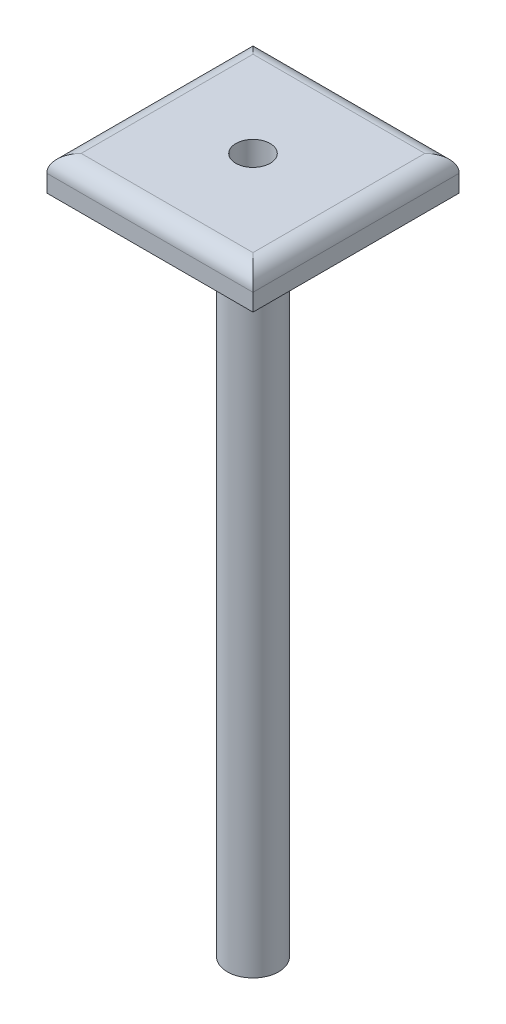
ISO-10303-21;
HEADER;
FILE_DESCRIPTION(('STEP AP214'),'2;1');
FILE_NAME('part.step','',(''),(''),'','','');
FILE_SCHEMA(('AUTOMOTIVE_DESIGN { 1 0 10303 214 1 1 1 1 }'));
ENDSEC;
DATA;
#1=APPLICATION_CONTEXT('core data for automotive mechanical design processes');
#2=APPLICATION_PROTOCOL_DEFINITION('international standard','automotive_design',2000,#1);
#3=PRODUCT_CONTEXT('',#1,'mechanical');
#4=PRODUCT('Part','Part','',(#3));
#5=PRODUCT_RELATED_PRODUCT_CATEGORY('part','',(#4));
#6=PRODUCT_DEFINITION_FORMATION('','',#4);
#7=PRODUCT_DEFINITION_CONTEXT('part definition',#1,'design');
#8=PRODUCT_DEFINITION('design','',#6,#7);
#9=PRODUCT_DEFINITION_SHAPE('','',#8);
#10=(LENGTH_UNIT() NAMED_UNIT(*) SI_UNIT(.MILLI.,.METRE.));
#11=(NAMED_UNIT(*) PLANE_ANGLE_UNIT() SI_UNIT($,.RADIAN.));
#12=(NAMED_UNIT(*) SI_UNIT($,.STERADIAN.) SOLID_ANGLE_UNIT());
#13=UNCERTAINTY_MEASURE_WITH_UNIT(LENGTH_MEASURE(1.E-05),#10,'distance_accuracy_value','');
#14=(GEOMETRIC_REPRESENTATION_CONTEXT(3) GLOBAL_UNCERTAINTY_ASSIGNED_CONTEXT((#13)) GLOBAL_UNIT_ASSIGNED_CONTEXT((#10,
#11,#12)) REPRESENTATION_CONTEXT('',''));
#15=CARTESIAN_POINT('',(0.,0.,0.));
#16=DIRECTION('',(0.,0.,1.));
#17=DIRECTION('',(1.,0.,0.));
#18=AXIS2_PLACEMENT_3D('',#15,#16,#17);
#19=CARTESIAN_POINT('',(15.24,5.08,-15.24));
#20=DIRECTION('',(-1.,0.,0.));
#21=DIRECTION('',(0.,0.,1.));
#22=AXIS2_PLACEMENT_3D('',#19,#20,#21);
#23=PLANE('',#22);
#24=DIRECTION('',(0.,-1.,0.));
#25=VECTOR('',#24,1.);
#26=CARTESIAN_POINT('',(15.24,5.08,-15.24));
#27=LINE('',#26,#25);
#28=CARTESIAN_POINT('',(15.24,2.54,-15.24));
#29=VERTEX_POINT('',#28);
#30=CARTESIAN_POINT('',(15.24,0.,-15.24));
#31=VERTEX_POINT('',#30);
#32=EDGE_CURVE('E94',#29,#31,#27,.T.);
#33=ORIENTED_EDGE('',*,*,#32,.F.);
#34=DIRECTION('',(0.,0.,-1.));
#35=VECTOR('',#34,1.);
#36=CARTESIAN_POINT('',(15.24,2.54,15.24));
#37=LINE('',#36,#35);
#38=CARTESIAN_POINT('',(15.24,2.54,15.24));
#39=VERTEX_POINT('',#38);
#40=EDGE_CURVE('E49',#29,#39,#37,.F.);
#41=ORIENTED_EDGE('',*,*,#40,.T.);
#42=DIRECTION('',(0.,-1.,0.));
#43=VECTOR('',#42,1.);
#44=CARTESIAN_POINT('',(15.24,5.08,15.24));
#45=LINE('',#44,#43);
#46=CARTESIAN_POINT('',(15.24,0.,15.24));
#47=VERTEX_POINT('',#46);
#48=EDGE_CURVE('E116',#39,#47,#45,.T.);
#49=ORIENTED_EDGE('',*,*,#48,.T.);
#50=DIRECTION('',(0.,0.,-1.));
#51=VECTOR('',#50,1.);
#52=CARTESIAN_POINT('',(15.24,0.,-15.24));
#53=LINE('',#52,#51);
#54=EDGE_CURVE('E110',#47,#31,#53,.T.);
#55=ORIENTED_EDGE('',*,*,#54,.T.);
#56=EDGE_LOOP('',(#33,#41,#49,#55));
#57=FACE_BOUND('',#56,.T.);
#58=ADVANCED_FACE('F39',(#57),#23,.F.);
#59=CARTESIAN_POINT('',(-15.24,5.08,-15.24));
#60=DIRECTION('',(0.,0.,1.));
#61=DIRECTION('',(1.,0.,0.));
#62=AXIS2_PLACEMENT_3D('',#59,#60,#61);
#63=PLANE('',#62);
#64=DIRECTION('',(0.,-1.,0.));
#65=VECTOR('',#64,1.);
#66=CARTESIAN_POINT('',(-15.24,5.08,-15.24));
#67=LINE('',#66,#65);
#68=CARTESIAN_POINT('',(-15.24,2.54,-15.24));
#69=VERTEX_POINT('',#68);
#70=CARTESIAN_POINT('',(-15.24,0.,-15.24));
#71=VERTEX_POINT('',#70);
#72=EDGE_CURVE('E104',#69,#71,#67,.T.);
#73=ORIENTED_EDGE('',*,*,#72,.F.);
#74=DIRECTION('',(-1.,0.,0.));
#75=VECTOR('',#74,1.);
#76=CARTESIAN_POINT('',(15.24,2.54,-15.24));
#77=LINE('',#76,#75);
#78=EDGE_CURVE('E57',#69,#29,#77,.F.);
#79=ORIENTED_EDGE('',*,*,#78,.T.);
#80=ORIENTED_EDGE('',*,*,#32,.T.);
#81=DIRECTION('',(-1.,0.,0.));
#82=VECTOR('',#81,1.);
#83=CARTESIAN_POINT('',(-15.24,0.,-15.24));
#84=LINE('',#83,#82);
#85=EDGE_CURVE('E97',#31,#71,#84,.T.);
#86=ORIENTED_EDGE('',*,*,#85,.T.);
#87=EDGE_LOOP('',(#73,#79,#80,#86));
#88=FACE_BOUND('',#87,.T.);
#89=ADVANCED_FACE('F96',(#88),#63,.F.);
#90=CARTESIAN_POINT('',(-15.24,5.08,-15.24));
#91=DIRECTION('',(1.,0.,0.));
#92=DIRECTION('',(0.,0.,-1.));
#93=AXIS2_PLACEMENT_3D('',#90,#91,#92);
#94=PLANE('',#93);
#95=DIRECTION('',(0.,-1.,0.));
#96=VECTOR('',#95,1.);
#97=CARTESIAN_POINT('',(-15.24,5.08,15.24));
#98=LINE('',#97,#96);
#99=CARTESIAN_POINT('',(-15.24,2.54,15.24));
#100=VERTEX_POINT('',#99);
#101=CARTESIAN_POINT('',(-15.24,0.,15.24));
#102=VERTEX_POINT('',#101);
#103=EDGE_CURVE('E132',#100,#102,#98,.T.);
#104=ORIENTED_EDGE('',*,*,#103,.F.);
#105=DIRECTION('',(0.,0.,1.));
#106=VECTOR('',#105,1.);
#107=CARTESIAN_POINT('',(-15.24,2.54,-15.24));
#108=LINE('',#107,#106);
#109=EDGE_CURVE('E65',#100,#69,#108,.F.);
#110=ORIENTED_EDGE('',*,*,#109,.T.);
#111=ORIENTED_EDGE('',*,*,#72,.T.);
#112=DIRECTION('',(0.,0.,1.));
#113=VECTOR('',#112,1.);
#114=CARTESIAN_POINT('',(-15.24,0.,-15.24));
#115=LINE('',#114,#113);
#116=EDGE_CURVE('E112',#71,#102,#115,.T.);
#117=ORIENTED_EDGE('',*,*,#116,.T.);
#118=EDGE_LOOP('',(#104,#110,#111,#117));
#119=FACE_BOUND('',#118,.T.);
#120=ADVANCED_FACE('F185',(#119),#94,.F.);
#121=CARTESIAN_POINT('',(-15.24,5.08,15.24));
#122=DIRECTION('',(0.,0.,-1.));
#123=DIRECTION('',(-1.,0.,0.));
#124=AXIS2_PLACEMENT_3D('',#121,#122,#123);
#125=PLANE('',#124);
#126=ORIENTED_EDGE('',*,*,#48,.F.);
#127=DIRECTION('',(1.,0.,0.));
#128=VECTOR('',#127,1.);
#129=CARTESIAN_POINT('',(-15.24,2.54,15.24));
#130=LINE('',#129,#128);
#131=EDGE_CURVE('E149',#39,#100,#130,.F.);
#132=ORIENTED_EDGE('',*,*,#131,.T.);
#133=ORIENTED_EDGE('',*,*,#103,.T.);
#134=DIRECTION('',(1.,0.,0.));
#135=VECTOR('',#134,1.);
#136=CARTESIAN_POINT('',(-15.24,0.,15.24));
#137=LINE('',#136,#135);
#138=EDGE_CURVE('E127',#102,#47,#137,.T.);
#139=ORIENTED_EDGE('',*,*,#138,.T.);
#140=EDGE_LOOP('',(#126,#132,#133,#139));
#141=FACE_BOUND('',#140,.T.);
#142=ADVANCED_FACE('F184',(#141),#125,.F.);
#143=CARTESIAN_POINT('',(0.,5.08,0.));
#144=DIRECTION('',(0.,1.,0.));
#145=DIRECTION('',(0.,0.,1.));
#146=AXIS2_PLACEMENT_3D('',#143,#144,#145);
#147=PLANE('',#146);
#148=CARTESIAN_POINT('',(0.,5.08,0.));
#149=DIRECTION('',(0.,1.,0.));
#150=DIRECTION('',(0.,0.,1.));
#151=AXIS2_PLACEMENT_3D('',#148,#149,#150);
#152=CIRCLE('',#151,2.54);
#153=CARTESIAN_POINT('',(0.,5.08,2.54));
#154=VERTEX_POINT('',#153);
#155=EDGE_CURVE('E241',#154,#154,#152,.T.);
#156=ORIENTED_EDGE('',*,*,#155,.F.);
#157=EDGE_LOOP('',(#156));
#158=FACE_BOUND('',#157,.T.);
#159=DIRECTION('',(0.,0.,1.));
#160=VECTOR('',#159,1.);
#161=CARTESIAN_POINT('',(-12.7,5.08,15.24));
#162=LINE('',#161,#160);
#163=CARTESIAN_POINT('',(-12.7,5.08,-12.7));
#164=VERTEX_POINT('',#163);
#165=CARTESIAN_POINT('',(-12.7,5.08,12.7));
#166=VERTEX_POINT('',#165);
#167=EDGE_CURVE('E142',#164,#166,#162,.T.);
#168=ORIENTED_EDGE('',*,*,#167,.T.);
#169=DIRECTION('',(1.,0.,0.));
#170=VECTOR('',#169,1.);
#171=CARTESIAN_POINT('',(15.24,5.08,12.7));
#172=LINE('',#171,#170);
#173=CARTESIAN_POINT('',(12.7,5.08,12.7));
#174=VERTEX_POINT('',#173);
#175=EDGE_CURVE('E145',#166,#174,#172,.T.);
#176=ORIENTED_EDGE('',*,*,#175,.T.);
#177=DIRECTION('',(0.,0.,-1.));
#178=VECTOR('',#177,1.);
#179=CARTESIAN_POINT('',(12.7,5.08,-15.24));
#180=LINE('',#179,#178);
#181=CARTESIAN_POINT('',(12.7,5.08,-12.7));
#182=VERTEX_POINT('',#181);
#183=EDGE_CURVE('E103',#174,#182,#180,.T.);
#184=ORIENTED_EDGE('',*,*,#183,.T.);
#185=DIRECTION('',(-1.,0.,0.));
#186=VECTOR('',#185,1.);
#187=CARTESIAN_POINT('',(-15.24,5.08,-12.7));
#188=LINE('',#187,#186);
#189=EDGE_CURVE('E139',#182,#164,#188,.T.);
#190=ORIENTED_EDGE('',*,*,#189,.T.);
#191=EDGE_LOOP('',(#168,#176,#184,#190));
#192=FACE_BOUND('',#191,.T.);
#193=ADVANCED_FACE('F177',(#158,#192),#147,.T.);
#194=CARTESIAN_POINT('',(0.,0.,0.));
#195=DIRECTION('',(0.,1.,0.));
#196=DIRECTION('',(0.,0.,1.));
#197=AXIS2_PLACEMENT_3D('',#194,#195,#196);
#198=PLANE('',#197);
#199=CARTESIAN_POINT('',(0.,0.,0.));
#200=DIRECTION('',(0.,-1.,0.));
#201=DIRECTION('',(0.,0.,-1.));
#202=AXIS2_PLACEMENT_3D('',#199,#200,#201);
#203=CIRCLE('',#202,3.81);
#204=CARTESIAN_POINT('',(0.,0.,-3.81));
#205=VERTEX_POINT('',#204);
#206=EDGE_CURVE('E11',#205,#205,#203,.T.);
#207=ORIENTED_EDGE('',*,*,#206,.F.);
#208=EDGE_LOOP('',(#207));
#209=FACE_BOUND('',#208,.T.);
#210=ORIENTED_EDGE('',*,*,#54,.F.);
#211=ORIENTED_EDGE('',*,*,#138,.F.);
#212=ORIENTED_EDGE('',*,*,#116,.F.);
#213=ORIENTED_EDGE('',*,*,#85,.F.);
#214=EDGE_LOOP('',(#210,#211,#212,#213));
#215=FACE_BOUND('',#214,.T.);
#216=ADVANCED_FACE('F108',(#209,#215),#198,.F.);
#217=CARTESIAN_POINT('',(0.,2.54,-12.7));
#218=DIRECTION('',(1.,0.,0.));
#219=DIRECTION('',(0.,0.,-1.));
#220=AXIS2_PLACEMENT_3D('',#217,#218,#219);
#221=CYLINDRICAL_SURFACE('',#220,2.54);
#222=CARTESIAN_POINT('',(12.7,2.54,-12.7));
#223=DIRECTION('',(0.707106781186547,0.,0.707106781186547));
#224=DIRECTION('',(-0.707106781186547,0.,0.707106781186547));
#225=AXIS2_PLACEMENT_3D('',#222,#223,#224);
#226=ELLIPSE('',#225,3.59210244842766,2.54);
#227=EDGE_CURVE('E122',#29,#182,#226,.T.);
#228=ORIENTED_EDGE('',*,*,#227,.F.);
#229=ORIENTED_EDGE('',*,*,#78,.F.);
#230=CARTESIAN_POINT('',(-12.7,2.54,-12.7));
#231=DIRECTION('',(0.707106781186547,0.,-0.707106781186548));
#232=DIRECTION('',(0.707106781186548,0.,0.707106781186547));
#233=AXIS2_PLACEMENT_3D('',#230,#231,#232);
#234=ELLIPSE('',#233,3.59210244842766,2.54);
#235=EDGE_CURVE('E43',#164,#69,#234,.F.);
#236=ORIENTED_EDGE('',*,*,#235,.F.);
#237=ORIENTED_EDGE('',*,*,#189,.F.);
#238=EDGE_LOOP('',(#228,#229,#236,#237));
#239=FACE_BOUND('',#238,.T.);
#240=ADVANCED_FACE('F41',(#239),#221,.T.);
#241=CARTESIAN_POINT('',(-12.7,2.54,0.));
#242=DIRECTION('',(0.,0.,-1.));
#243=DIRECTION('',(-1.,0.,0.));
#244=AXIS2_PLACEMENT_3D('',#241,#242,#243);
#245=CYLINDRICAL_SURFACE('',#244,2.54);
#246=ORIENTED_EDGE('',*,*,#235,.T.);
#247=ORIENTED_EDGE('',*,*,#109,.F.);
#248=CARTESIAN_POINT('',(-12.7,2.54,12.7));
#249=DIRECTION('',(-0.707106781186548,0.,-0.707106781186547));
#250=DIRECTION('',(0.707106781186547,0.,-0.707106781186548));
#251=AXIS2_PLACEMENT_3D('',#248,#249,#250);
#252=ELLIPSE('',#251,3.59210244842766,2.54);
#253=EDGE_CURVE('E162',#166,#100,#252,.F.);
#254=ORIENTED_EDGE('',*,*,#253,.F.);
#255=ORIENTED_EDGE('',*,*,#167,.F.);
#256=EDGE_LOOP('',(#246,#247,#254,#255));
#257=FACE_BOUND('',#256,.T.);
#258=ADVANCED_FACE('F203',(#257),#245,.T.);
#259=CARTESIAN_POINT('',(12.7,2.54,0.));
#260=DIRECTION('',(0.,0.,1.));
#261=DIRECTION('',(1.,0.,0.));
#262=AXIS2_PLACEMENT_3D('',#259,#260,#261);
#263=CYLINDRICAL_SURFACE('',#262,2.54);
#264=ORIENTED_EDGE('',*,*,#227,.T.);
#265=ORIENTED_EDGE('',*,*,#183,.F.);
#266=CARTESIAN_POINT('',(12.7,2.54,12.7));
#267=DIRECTION('',(-0.707106781186547,0.,0.707106781186547));
#268=DIRECTION('',(0.707106781186547,0.,0.707106781186547));
#269=AXIS2_PLACEMENT_3D('',#266,#267,#268);
#270=ELLIPSE('',#269,3.59210244842766,2.54);
#271=EDGE_CURVE('E159',#39,#174,#270,.T.);
#272=ORIENTED_EDGE('',*,*,#271,.F.);
#273=ORIENTED_EDGE('',*,*,#40,.F.);
#274=EDGE_LOOP('',(#264,#265,#272,#273));
#275=FACE_BOUND('',#274,.T.);
#276=ADVANCED_FACE('F170',(#275),#263,.T.);
#277=CARTESIAN_POINT('',(0.,2.54,12.7));
#278=DIRECTION('',(-1.,0.,0.));
#279=DIRECTION('',(0.,0.,1.));
#280=AXIS2_PLACEMENT_3D('',#277,#278,#279);
#281=CYLINDRICAL_SURFACE('',#280,2.54);
#282=ORIENTED_EDGE('',*,*,#253,.T.);
#283=ORIENTED_EDGE('',*,*,#131,.F.);
#284=ORIENTED_EDGE('',*,*,#271,.T.);
#285=ORIENTED_EDGE('',*,*,#175,.F.);
#286=EDGE_LOOP('',(#282,#283,#284,#285));
#287=FACE_BOUND('',#286,.T.);
#288=ADVANCED_FACE('F181',(#287),#281,.T.);
#289=CARTESIAN_POINT('',(0.,-97.79,0.));
#290=DIRECTION('',(0.,1.,0.));
#291=DIRECTION('',(0.,0.,1.));
#292=AXIS2_PLACEMENT_3D('',#289,#290,#291);
#293=CYLINDRICAL_SURFACE('',#292,3.81);
#294=CARTESIAN_POINT('',(0.,-97.79,0.));
#295=DIRECTION('',(0.,-1.,0.));
#296=DIRECTION('',(0.,0.,-1.));
#297=AXIS2_PLACEMENT_3D('',#294,#295,#296);
#298=CIRCLE('',#297,3.81);
#299=CARTESIAN_POINT('',(0.,-97.79,-3.81));
#300=VERTEX_POINT('',#299);
#301=EDGE_CURVE('E163',#300,#300,#298,.T.);
#302=ORIENTED_EDGE('',*,*,#301,.F.);
#303=EDGE_LOOP('',(#302));
#304=FACE_BOUND('',#303,.T.);
#305=ORIENTED_EDGE('',*,*,#206,.T.);
#306=EDGE_LOOP('',(#305));
#307=FACE_BOUND('',#306,.T.);
#308=ADVANCED_FACE('F201',(#304,#307),#293,.T.);
#309=CARTESIAN_POINT('',(0.,-97.79,0.));
#310=DIRECTION('',(0.,-1.,0.));
#311=DIRECTION('',(0.,0.,-1.));
#312=AXIS2_PLACEMENT_3D('',#309,#310,#311);
#313=PLANE('',#312);
#314=ORIENTED_EDGE('',*,*,#301,.T.);
#315=EDGE_LOOP('',(#314));
#316=FACE_BOUND('',#315,.T.);
#317=ADVANCED_FACE('F223',(#316),#313,.T.);
#318=CARTESIAN_POINT('',(0.,-96.52,0.));
#319=DIRECTION('',(0.,1.,0.));
#320=DIRECTION('',(0.,0.,1.));
#321=AXIS2_PLACEMENT_3D('',#318,#319,#320);
#322=CYLINDRICAL_SURFACE('',#321,2.54);
#323=CARTESIAN_POINT('',(0.,-96.52,0.));
#324=DIRECTION('',(0.,1.,0.));
#325=DIRECTION('',(0.,0.,1.));
#326=AXIS2_PLACEMENT_3D('',#323,#324,#325);
#327=CIRCLE('',#326,2.54);
#328=CARTESIAN_POINT('',(0.,-96.52,2.54));
#329=VERTEX_POINT('',#328);
#330=EDGE_CURVE('E239',#329,#329,#327,.T.);
#331=ORIENTED_EDGE('',*,*,#330,.F.);
#332=EDGE_LOOP('',(#331));
#333=FACE_BOUND('',#332,.T.);
#334=ORIENTED_EDGE('',*,*,#155,.T.);
#335=EDGE_LOOP('',(#334));
#336=FACE_BOUND('',#335,.T.);
#337=ADVANCED_FACE('F227',(#333,#336),#322,.F.);
#338=CARTESIAN_POINT('',(0.,-96.52,0.));
#339=DIRECTION('',(0.,1.,0.));
#340=DIRECTION('',(0.,0.,1.));
#341=AXIS2_PLACEMENT_3D('',#338,#339,#340);
#342=PLANE('',#341);
#343=ORIENTED_EDGE('',*,*,#330,.T.);
#344=EDGE_LOOP('',(#343));
#345=FACE_BOUND('',#344,.T.);
#346=ADVANCED_FACE('F231',(#345),#342,.T.);
#347=CLOSED_SHELL('',(#58,#89,#120,#142,#193,#216,#240,#258,#276,#288,#308,#317,#337,#346));
#348=MANIFOLD_SOLID_BREP('B2',#347);
#349=ADVANCED_BREP_SHAPE_REPRESENTATION('',(#18,#348),#14);
#350=SHAPE_DEFINITION_REPRESENTATION(#9,#349);
ENDSEC;
END-ISO-10303-21;
